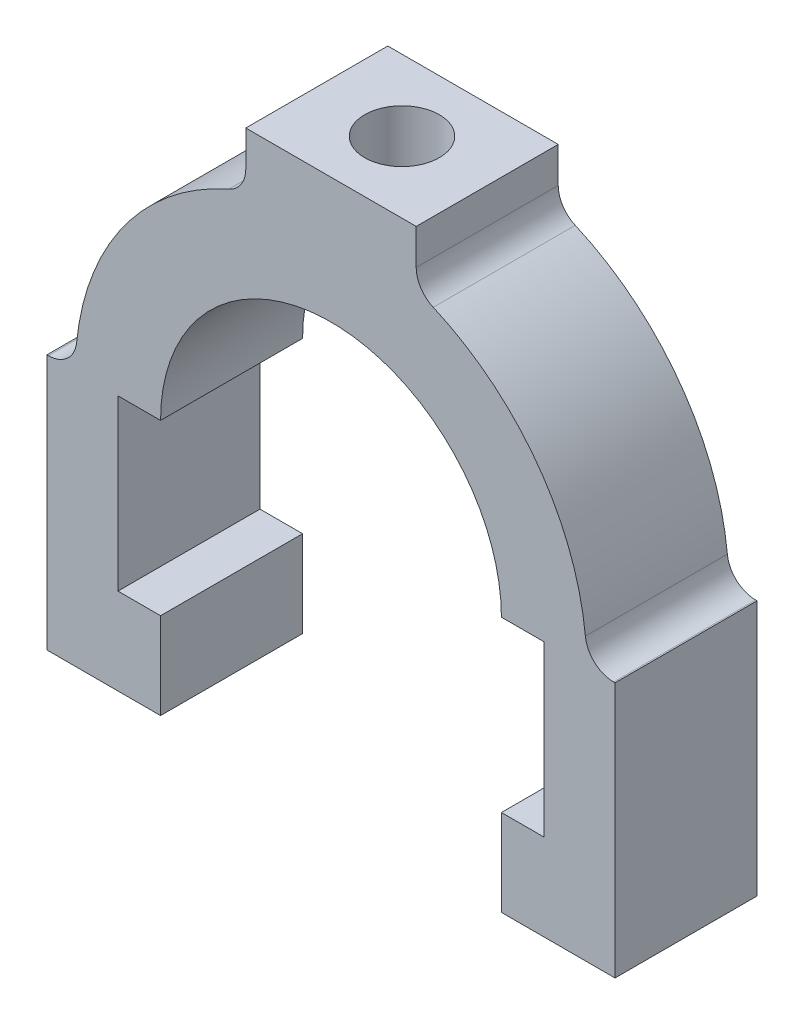
ISO-10303-21;
HEADER;
FILE_DESCRIPTION(('STEP AP214'),'2;1');
FILE_NAME('part.step','',(''),(''),'','','');
FILE_SCHEMA(('AUTOMOTIVE_DESIGN { 1 0 10303 214 1 1 1 1 }'));
ENDSEC;
DATA;
#1=APPLICATION_CONTEXT('core data for automotive mechanical design processes');
#2=APPLICATION_PROTOCOL_DEFINITION('international standard','automotive_design',2000,#1);
#3=PRODUCT_CONTEXT('',#1,'mechanical');
#4=PRODUCT('Part','Part','',(#3));
#5=PRODUCT_RELATED_PRODUCT_CATEGORY('part','',(#4));
#6=PRODUCT_DEFINITION_FORMATION('','',#4);
#7=PRODUCT_DEFINITION_CONTEXT('part definition',#1,'design');
#8=PRODUCT_DEFINITION('design','',#6,#7);
#9=PRODUCT_DEFINITION_SHAPE('','',#8);
#10=(LENGTH_UNIT() NAMED_UNIT(*) SI_UNIT(.MILLI.,.METRE.));
#11=(NAMED_UNIT(*) PLANE_ANGLE_UNIT() SI_UNIT($,.RADIAN.));
#12=(NAMED_UNIT(*) SI_UNIT($,.STERADIAN.) SOLID_ANGLE_UNIT());
#13=UNCERTAINTY_MEASURE_WITH_UNIT(LENGTH_MEASURE(1.E-05),#10,'distance_accuracy_value','');
#14=(GEOMETRIC_REPRESENTATION_CONTEXT(3) GLOBAL_UNCERTAINTY_ASSIGNED_CONTEXT((#13)) GLOBAL_UNIT_ASSIGNED_CONTEXT((#10,
#11,#12)) REPRESENTATION_CONTEXT('',''));
#15=CARTESIAN_POINT('',(0.,0.,0.));
#16=DIRECTION('',(0.,0.,1.));
#17=DIRECTION('',(1.,0.,0.));
#18=AXIS2_PLACEMENT_3D('',#15,#16,#17);
#19=CARTESIAN_POINT('',(24.,0.,20.));
#20=DIRECTION('',(0.,1.,0.));
#21=DIRECTION('',(0.,0.,1.));
#22=AXIS2_PLACEMENT_3D('',#19,#20,#21);
#23=PLANE('',#22);
#24=DIRECTION('',(1.,0.,0.));
#25=VECTOR('',#24,1.);
#26=CARTESIAN_POINT('',(24.,0.,0.));
#27=LINE('',#26,#25);
#28=CARTESIAN_POINT('',(24.,0.,0.));
#29=VERTEX_POINT('',#28);
#30=CARTESIAN_POINT('',(30.,0.,0.));
#31=VERTEX_POINT('',#30);
#32=EDGE_CURVE('E242',#29,#31,#27,.T.);
#33=ORIENTED_EDGE('',*,*,#32,.T.);
#34=DIRECTION('',(0.,0.,-1.));
#35=VECTOR('',#34,1.);
#36=CARTESIAN_POINT('',(30.,0.,20.));
#37=LINE('',#36,#35);
#38=CARTESIAN_POINT('',(30.,0.,20.));
#39=VERTEX_POINT('',#38);
#40=EDGE_CURVE('E11',#39,#31,#37,.T.);
#41=ORIENTED_EDGE('',*,*,#40,.F.);
#42=DIRECTION('',(1.,0.,0.));
#43=VECTOR('',#42,1.);
#44=CARTESIAN_POINT('',(24.,0.,20.));
#45=LINE('',#44,#43);
#46=CARTESIAN_POINT('',(24.,0.,20.));
#47=VERTEX_POINT('',#46);
#48=EDGE_CURVE('E312',#47,#39,#45,.T.);
#49=ORIENTED_EDGE('',*,*,#48,.F.);
#50=DIRECTION('',(0.,0.,-1.));
#51=VECTOR('',#50,1.);
#52=CARTESIAN_POINT('',(24.,0.,20.));
#53=LINE('',#52,#51);
#54=EDGE_CURVE('E238',#47,#29,#53,.T.);
#55=ORIENTED_EDGE('',*,*,#54,.T.);
#56=EDGE_LOOP('',(#33,#41,#49,#55));
#57=FACE_BOUND('',#56,.T.);
#58=ADVANCED_FACE('F39',(#57),#23,.F.);
#59=CARTESIAN_POINT('',(30.,0.,20.));
#60=DIRECTION('',(1.,0.,0.));
#61=DIRECTION('',(0.,1.,0.));
#62=AXIS2_PLACEMENT_3D('',#59,#60,#61);
#63=PLANE('',#62);
#64=DIRECTION('',(0.,-1.,0.));
#65=VECTOR('',#64,1.);
#66=CARTESIAN_POINT('',(30.,0.,0.));
#67=LINE('',#66,#65);
#68=CARTESIAN_POINT('',(30.,-23.8167393900885,0.));
#69=VERTEX_POINT('',#68);
#70=EDGE_CURVE('E246',#31,#69,#67,.T.);
#71=ORIENTED_EDGE('',*,*,#70,.T.);
#72=DIRECTION('',(0.,0.,-1.));
#73=VECTOR('',#72,1.);
#74=CARTESIAN_POINT('',(30.,-23.8167393900885,20.));
#75=LINE('',#74,#73);
#76=CARTESIAN_POINT('',(30.,-23.8167393900885,20.));
#77=VERTEX_POINT('',#76);
#78=EDGE_CURVE('E54',#77,#69,#75,.T.);
#79=ORIENTED_EDGE('',*,*,#78,.F.);
#80=DIRECTION('',(0.,-1.,0.));
#81=VECTOR('',#80,1.);
#82=CARTESIAN_POINT('',(30.,0.,20.));
#83=LINE('',#82,#81);
#84=EDGE_CURVE('E153',#39,#77,#83,.T.);
#85=ORIENTED_EDGE('',*,*,#84,.F.);
#86=ORIENTED_EDGE('',*,*,#40,.T.);
#87=EDGE_LOOP('',(#71,#79,#85,#86));
#88=FACE_BOUND('',#87,.T.);
#89=ADVANCED_FACE('F493',(#88),#63,.F.);
#90=CARTESIAN_POINT('',(24.,-23.8167393900885,20.));
#91=DIRECTION('',(0.,-1.,0.));
#92=DIRECTION('',(1.,0.,0.));
#93=AXIS2_PLACEMENT_3D('',#90,#91,#92);
#94=PLANE('',#93);
#95=DIRECTION('',(-1.,0.,0.));
#96=VECTOR('',#95,1.);
#97=CARTESIAN_POINT('',(24.,-23.8167393900885,0.));
#98=LINE('',#97,#96);
#99=CARTESIAN_POINT('',(24.,-23.8167393900885,0.));
#100=VERTEX_POINT('',#99);
#101=EDGE_CURVE('E249',#69,#100,#98,.T.);
#102=ORIENTED_EDGE('',*,*,#101,.T.);
#103=DIRECTION('',(0.,0.,-1.));
#104=VECTOR('',#103,1.);
#105=CARTESIAN_POINT('',(24.,-23.8167393900885,20.));
#106=LINE('',#105,#104);
#107=CARTESIAN_POINT('',(24.,-23.8167393900885,20.));
#108=VERTEX_POINT('',#107);
#109=EDGE_CURVE('E387',#108,#100,#106,.T.);
#110=ORIENTED_EDGE('',*,*,#109,.F.);
#111=DIRECTION('',(-1.,0.,0.));
#112=VECTOR('',#111,1.);
#113=CARTESIAN_POINT('',(24.,-23.8167393900885,20.));
#114=LINE('',#113,#112);
#115=EDGE_CURVE('E398',#77,#108,#114,.T.);
#116=ORIENTED_EDGE('',*,*,#115,.F.);
#117=ORIENTED_EDGE('',*,*,#78,.T.);
#118=EDGE_LOOP('',(#102,#110,#116,#117));
#119=FACE_BOUND('',#118,.T.);
#120=ADVANCED_FACE('F396',(#119),#94,.F.);
#121=CARTESIAN_POINT('',(24.,-36.,20.));
#122=DIRECTION('',(1.,0.,0.));
#123=DIRECTION('',(0.,0.,-1.));
#124=AXIS2_PLACEMENT_3D('',#121,#122,#123);
#125=PLANE('',#124);
#126=DIRECTION('',(0.,-1.,0.));
#127=VECTOR('',#126,1.);
#128=CARTESIAN_POINT('',(24.,-36.,0.));
#129=LINE('',#128,#127);
#130=CARTESIAN_POINT('',(24.,-36.,0.));
#131=VERTEX_POINT('',#130);
#132=EDGE_CURVE('E252',#100,#131,#129,.T.);
#133=ORIENTED_EDGE('',*,*,#132,.T.);
#134=DIRECTION('',(0.,0.,-1.));
#135=VECTOR('',#134,1.);
#136=CARTESIAN_POINT('',(24.,-36.,20.));
#137=LINE('',#136,#135);
#138=CARTESIAN_POINT('',(24.,-36.,20.));
#139=VERTEX_POINT('',#138);
#140=EDGE_CURVE('E383',#139,#131,#137,.T.);
#141=ORIENTED_EDGE('',*,*,#140,.F.);
#142=DIRECTION('',(0.,-1.,0.));
#143=VECTOR('',#142,1.);
#144=CARTESIAN_POINT('',(24.,-36.,20.));
#145=LINE('',#144,#143);
#146=EDGE_CURVE('E417',#108,#139,#145,.T.);
#147=ORIENTED_EDGE('',*,*,#146,.F.);
#148=ORIENTED_EDGE('',*,*,#109,.T.);
#149=EDGE_LOOP('',(#133,#141,#147,#148));
#150=FACE_BOUND('',#149,.T.);
#151=ADVANCED_FACE('F407',(#150),#125,.F.);
#152=CARTESIAN_POINT('',(40.,-36.,20.));
#153=DIRECTION('',(0.,1.,0.));
#154=DIRECTION('',(0.,0.,1.));
#155=AXIS2_PLACEMENT_3D('',#152,#153,#154);
#156=PLANE('',#155);
#157=DIRECTION('',(1.,0.,0.));
#158=VECTOR('',#157,1.);
#159=CARTESIAN_POINT('',(40.,-36.,0.));
#160=LINE('',#159,#158);
#161=CARTESIAN_POINT('',(40.,-36.,0.));
#162=VERTEX_POINT('',#161);
#163=EDGE_CURVE('E255',#131,#162,#160,.T.);
#164=ORIENTED_EDGE('',*,*,#163,.T.);
#165=DIRECTION('',(0.,0.,-1.));
#166=VECTOR('',#165,1.);
#167=CARTESIAN_POINT('',(40.,-36.,20.));
#168=LINE('',#167,#166);
#169=CARTESIAN_POINT('',(40.,-36.,20.));
#170=VERTEX_POINT('',#169);
#171=EDGE_CURVE('E379',#170,#162,#168,.T.);
#172=ORIENTED_EDGE('',*,*,#171,.F.);
#173=DIRECTION('',(1.,0.,0.));
#174=VECTOR('',#173,1.);
#175=CARTESIAN_POINT('',(40.,-36.,20.));
#176=LINE('',#175,#174);
#177=EDGE_CURVE('E413',#139,#170,#176,.T.);
#178=ORIENTED_EDGE('',*,*,#177,.F.);
#179=ORIENTED_EDGE('',*,*,#140,.T.);
#180=EDGE_LOOP('',(#164,#172,#178,#179));
#181=FACE_BOUND('',#180,.T.);
#182=ADVANCED_FACE('F411',(#181),#156,.F.);
#183=CARTESIAN_POINT('',(40.,0.,20.));
#184=DIRECTION('',(-1.,0.,0.));
#185=DIRECTION('',(0.,-1.,0.));
#186=AXIS2_PLACEMENT_3D('',#183,#184,#185);
#187=PLANE('',#186);
#188=DIRECTION('',(0.,1.,0.));
#189=VECTOR('',#188,1.);
#190=CARTESIAN_POINT('',(40.,0.,0.));
#191=LINE('',#190,#189);
#192=CARTESIAN_POINT('',(40.,0.,0.));
#193=VERTEX_POINT('',#192);
#194=EDGE_CURVE('E258',#162,#193,#191,.T.);
#195=ORIENTED_EDGE('',*,*,#194,.T.);
#196=DIRECTION('',(0.,0.,-1.));
#197=VECTOR('',#196,1.);
#198=CARTESIAN_POINT('',(40.,0.,20.));
#199=LINE('',#198,#197);
#200=CARTESIAN_POINT('',(40.,0.,20.));
#201=VERTEX_POINT('',#200);
#202=EDGE_CURVE('E375',#201,#193,#199,.T.);
#203=ORIENTED_EDGE('',*,*,#202,.F.);
#204=DIRECTION('',(0.,1.,0.));
#205=VECTOR('',#204,1.);
#206=CARTESIAN_POINT('',(40.,0.,20.));
#207=LINE('',#206,#205);
#208=EDGE_CURVE('E416',#170,#201,#207,.T.);
#209=ORIENTED_EDGE('',*,*,#208,.F.);
#210=ORIENTED_EDGE('',*,*,#171,.T.);
#211=EDGE_LOOP('',(#195,#203,#209,#210));
#212=FACE_BOUND('',#211,.T.);
#213=ADVANCED_FACE('F506',(#212),#187,.F.);
#214=CARTESIAN_POINT('',(39.7994974842648,0.,20.));
#215=DIRECTION('',(0.,-1.,0.));
#216=DIRECTION('',(0.,0.,-1.));
#217=AXIS2_PLACEMENT_3D('',#214,#215,#216);
#218=PLANE('',#217);
#219=DIRECTION('',(-1.,0.,0.));
#220=VECTOR('',#219,1.);
#221=CARTESIAN_POINT('',(39.7994974842648,0.,0.));
#222=LINE('',#221,#220);
#223=CARTESIAN_POINT('',(39.7994974842648,0.,0.));
#224=VERTEX_POINT('',#223);
#225=EDGE_CURVE('E261',#193,#224,#222,.T.);
#226=ORIENTED_EDGE('',*,*,#225,.T.);
#227=DIRECTION('',(0.,0.,-1.));
#228=VECTOR('',#227,1.);
#229=CARTESIAN_POINT('',(39.7994974842648,0.,20.));
#230=LINE('',#229,#228);
#231=CARTESIAN_POINT('',(39.7994974842648,0.,20.));
#232=VERTEX_POINT('',#231);
#233=EDGE_CURVE('E371',#232,#224,#230,.T.);
#234=ORIENTED_EDGE('',*,*,#233,.F.);
#235=DIRECTION('',(-1.,0.,0.));
#236=VECTOR('',#235,1.);
#237=CARTESIAN_POINT('',(39.7994974842648,0.,20.));
#238=LINE('',#237,#236);
#239=EDGE_CURVE('E421',#201,#232,#238,.T.);
#240=ORIENTED_EDGE('',*,*,#239,.F.);
#241=ORIENTED_EDGE('',*,*,#202,.T.);
#242=EDGE_LOOP('',(#226,#234,#240,#241));
#243=FACE_BOUND('',#242,.T.);
#244=ADVANCED_FACE('F509',(#243),#218,.F.);
#245=CARTESIAN_POINT('',(39.7994974842648,4.,20.));
#246=DIRECTION('',(0.,0.,-1.));
#247=DIRECTION('',(-1.,0.,0.));
#248=AXIS2_PLACEMENT_3D('',#245,#246,#247);
#249=CYLINDRICAL_SURFACE('',#248,4.);
#250=CARTESIAN_POINT('',(39.7994974842648,4.,0.));
#251=DIRECTION('',(0.,0.,-1.));
#252=DIRECTION('',(1.,0.,0.));
#253=AXIS2_PLACEMENT_3D('',#250,#251,#252);
#254=CIRCLE('',#253,4.);
#255=CARTESIAN_POINT('',(35.8195477358383,3.6,0.));
#256=VERTEX_POINT('',#255);
#257=EDGE_CURVE('E264',#224,#256,#254,.T.);
#258=ORIENTED_EDGE('',*,*,#257,.T.);
#259=DIRECTION('',(0.,0.,-1.));
#260=VECTOR('',#259,1.);
#261=CARTESIAN_POINT('',(35.8195477358383,3.6,20.));
#262=LINE('',#261,#260);
#263=CARTESIAN_POINT('',(35.8195477358383,3.6,20.));
#264=VERTEX_POINT('',#263);
#265=EDGE_CURVE('E367',#264,#256,#262,.T.);
#266=ORIENTED_EDGE('',*,*,#265,.F.);
#267=CARTESIAN_POINT('',(39.7994974842648,4.,20.));
#268=DIRECTION('',(0.,0.,-1.));
#269=DIRECTION('',(1.,0.,0.));
#270=AXIS2_PLACEMENT_3D('',#267,#268,#269);
#271=CIRCLE('',#270,4.);
#272=EDGE_CURVE('E428',#232,#264,#271,.T.);
#273=ORIENTED_EDGE('',*,*,#272,.F.);
#274=ORIENTED_EDGE('',*,*,#233,.T.);
#275=EDGE_LOOP('',(#258,#266,#273,#274));
#276=FACE_BOUND('',#275,.T.);
#277=ADVANCED_FACE('F513',(#276),#249,.F.);
#278=CARTESIAN_POINT('',(0.,0.,20.));
#279=DIRECTION('',(0.,0.,-1.));
#280=DIRECTION('',(-1.,0.,0.));
#281=AXIS2_PLACEMENT_3D('',#278,#279,#280);
#282=CYLINDRICAL_SURFACE('',#281,36.);
#283=CARTESIAN_POINT('',(0.,0.,0.));
#284=DIRECTION('',(0.,0.,1.));
#285=DIRECTION('',(1.,0.,0.));
#286=AXIS2_PLACEMENT_3D('',#283,#284,#285);
#287=CIRCLE('',#286,36.);
#288=CARTESIAN_POINT('',(14.4,32.994545003682,0.));
#289=VERTEX_POINT('',#288);
#290=EDGE_CURVE('E267',#256,#289,#287,.T.);
#291=ORIENTED_EDGE('',*,*,#290,.T.);
#292=DIRECTION('',(0.,0.,-1.));
#293=VECTOR('',#292,1.);
#294=CARTESIAN_POINT('',(14.4,32.994545003682,20.));
#295=LINE('',#294,#293);
#296=CARTESIAN_POINT('',(14.4,32.994545003682,20.));
#297=VERTEX_POINT('',#296);
#298=EDGE_CURVE('E363',#297,#289,#295,.T.);
#299=ORIENTED_EDGE('',*,*,#298,.F.);
#300=CARTESIAN_POINT('',(0.,0.,20.));
#301=DIRECTION('',(0.,0.,1.));
#302=DIRECTION('',(1.,0.,0.));
#303=AXIS2_PLACEMENT_3D('',#300,#301,#302);
#304=CIRCLE('',#303,36.);
#305=EDGE_CURVE('E431',#264,#297,#304,.T.);
#306=ORIENTED_EDGE('',*,*,#305,.F.);
#307=ORIENTED_EDGE('',*,*,#265,.T.);
#308=EDGE_LOOP('',(#291,#299,#306,#307));
#309=FACE_BOUND('',#308,.T.);
#310=ADVANCED_FACE('F517',(#309),#282,.T.);
#311=CARTESIAN_POINT('',(16.,36.6606055596467,20.));
#312=DIRECTION('',(0.,0.,-1.));
#313=DIRECTION('',(-1.,0.,0.));
#314=AXIS2_PLACEMENT_3D('',#311,#312,#313);
#315=CYLINDRICAL_SURFACE('',#314,4.);
#316=CARTESIAN_POINT('',(16.,36.6606055596467,0.));
#317=DIRECTION('',(0.,0.,-1.));
#318=DIRECTION('',(1.,0.,0.));
#319=AXIS2_PLACEMENT_3D('',#316,#317,#318);
#320=CIRCLE('',#319,4.);
#321=CARTESIAN_POINT('',(12.,36.6606055596467,0.));
#322=VERTEX_POINT('',#321);
#323=EDGE_CURVE('E270',#289,#322,#320,.T.);
#324=ORIENTED_EDGE('',*,*,#323,.T.);
#325=DIRECTION('',(0.,0.,-1.));
#326=VECTOR('',#325,1.);
#327=CARTESIAN_POINT('',(12.,36.6606055596467,20.));
#328=LINE('',#327,#326);
#329=CARTESIAN_POINT('',(12.,36.6606055596467,20.));
#330=VERTEX_POINT('',#329);
#331=EDGE_CURVE('E359',#330,#322,#328,.T.);
#332=ORIENTED_EDGE('',*,*,#331,.F.);
#333=CARTESIAN_POINT('',(16.,36.6606055596467,20.));
#334=DIRECTION('',(0.,0.,-1.));
#335=DIRECTION('',(1.,0.,0.));
#336=AXIS2_PLACEMENT_3D('',#333,#334,#335);
#337=CIRCLE('',#336,4.);
#338=EDGE_CURVE('E434',#297,#330,#337,.T.);
#339=ORIENTED_EDGE('',*,*,#338,.F.);
#340=ORIENTED_EDGE('',*,*,#298,.T.);
#341=EDGE_LOOP('',(#324,#332,#339,#340));
#342=FACE_BOUND('',#341,.T.);
#343=ADVANCED_FACE('F521',(#342),#315,.F.);
#344=CARTESIAN_POINT('',(12.,41.6606055596467,20.));
#345=DIRECTION('',(-1.,0.,0.));
#346=DIRECTION('',(0.,-1.,0.));
#347=AXIS2_PLACEMENT_3D('',#344,#345,#346);
#348=PLANE('',#347);
#349=DIRECTION('',(0.,1.,0.));
#350=VECTOR('',#349,1.);
#351=CARTESIAN_POINT('',(12.,41.6606055596467,0.));
#352=LINE('',#351,#350);
#353=CARTESIAN_POINT('',(12.,41.6606055596467,0.));
#354=VERTEX_POINT('',#353);
#355=EDGE_CURVE('E273',#322,#354,#352,.T.);
#356=ORIENTED_EDGE('',*,*,#355,.T.);
#357=DIRECTION('',(0.,0.,-1.));
#358=VECTOR('',#357,1.);
#359=CARTESIAN_POINT('',(12.,41.6606055596467,20.));
#360=LINE('',#359,#358);
#361=CARTESIAN_POINT('',(12.,41.6606055596467,20.));
#362=VERTEX_POINT('',#361);
#363=EDGE_CURVE('E355',#362,#354,#360,.T.);
#364=ORIENTED_EDGE('',*,*,#363,.F.);
#365=DIRECTION('',(0.,1.,0.));
#366=VECTOR('',#365,1.);
#367=CARTESIAN_POINT('',(12.,41.6606055596467,20.));
#368=LINE('',#367,#366);
#369=EDGE_CURVE('E437',#330,#362,#368,.T.);
#370=ORIENTED_EDGE('',*,*,#369,.F.);
#371=ORIENTED_EDGE('',*,*,#331,.T.);
#372=EDGE_LOOP('',(#356,#364,#370,#371));
#373=FACE_BOUND('',#372,.T.);
#374=ADVANCED_FACE('F525',(#373),#348,.F.);
#375=CARTESIAN_POINT('',(-12.,41.6606055596467,20.));
#376=DIRECTION('',(0.,-1.,0.));
#377=DIRECTION('',(0.,0.,-1.));
#378=AXIS2_PLACEMENT_3D('',#375,#376,#377);
#379=PLANE('',#378);
#380=CARTESIAN_POINT('',(0.,41.6606055596467,10.));
#381=DIRECTION('',(0.,1.,0.));
#382=DIRECTION('',(0.,0.,1.));
#383=AXIS2_PLACEMENT_3D('',#380,#381,#382);
#384=CIRCLE('',#383,5.25129435468672);
#385=CARTESIAN_POINT('',(0.,41.6606055596467,15.2512943546867));
#386=VERTEX_POINT('',#385);
#387=EDGE_CURVE('E617',#386,#386,#384,.T.);
#388=ORIENTED_EDGE('',*,*,#387,.F.);
#389=EDGE_LOOP('',(#388));
#390=FACE_BOUND('',#389,.T.);
#391=DIRECTION('',(-1.,0.,0.));
#392=VECTOR('',#391,1.);
#393=CARTESIAN_POINT('',(-12.,41.6606055596467,0.));
#394=LINE('',#393,#392);
#395=CARTESIAN_POINT('',(-12.,41.6606055596467,0.));
#396=VERTEX_POINT('',#395);
#397=EDGE_CURVE('E276',#354,#396,#394,.T.);
#398=ORIENTED_EDGE('',*,*,#397,.T.);
#399=DIRECTION('',(0.,0.,-1.));
#400=VECTOR('',#399,1.);
#401=CARTESIAN_POINT('',(-12.,41.6606055596467,20.));
#402=LINE('',#401,#400);
#403=CARTESIAN_POINT('',(-12.,41.6606055596467,20.));
#404=VERTEX_POINT('',#403);
#405=EDGE_CURVE('E351',#404,#396,#402,.T.);
#406=ORIENTED_EDGE('',*,*,#405,.F.);
#407=DIRECTION('',(-1.,0.,0.));
#408=VECTOR('',#407,1.);
#409=CARTESIAN_POINT('',(-12.,41.6606055596467,20.));
#410=LINE('',#409,#408);
#411=EDGE_CURVE('E440',#362,#404,#410,.T.);
#412=ORIENTED_EDGE('',*,*,#411,.F.);
#413=ORIENTED_EDGE('',*,*,#363,.T.);
#414=EDGE_LOOP('',(#398,#406,#412,#413));
#415=FACE_BOUND('',#414,.T.);
#416=ADVANCED_FACE('F529',(#390,#415),#379,.F.);
#417=CARTESIAN_POINT('',(-12.,41.6606055596467,20.));
#418=DIRECTION('',(1.,0.,0.));
#419=DIRECTION('',(0.,0.,-1.));
#420=AXIS2_PLACEMENT_3D('',#417,#418,#419);
#421=PLANE('',#420);
#422=DIRECTION('',(0.,-1.,0.));
#423=VECTOR('',#422,1.);
#424=CARTESIAN_POINT('',(-12.,41.6606055596467,0.));
#425=LINE('',#424,#423);
#426=CARTESIAN_POINT('',(-12.,36.6606055596467,0.));
#427=VERTEX_POINT('',#426);
#428=EDGE_CURVE('E279',#396,#427,#425,.T.);
#429=ORIENTED_EDGE('',*,*,#428,.T.);
#430=DIRECTION('',(0.,0.,-1.));
#431=VECTOR('',#430,1.);
#432=CARTESIAN_POINT('',(-12.,36.6606055596467,20.));
#433=LINE('',#432,#431);
#434=CARTESIAN_POINT('',(-12.,36.6606055596467,20.));
#435=VERTEX_POINT('',#434);
#436=EDGE_CURVE('E347',#435,#427,#433,.T.);
#437=ORIENTED_EDGE('',*,*,#436,.F.);
#438=DIRECTION('',(0.,-1.,0.));
#439=VECTOR('',#438,1.);
#440=CARTESIAN_POINT('',(-12.,41.6606055596467,20.));
#441=LINE('',#440,#439);
#442=EDGE_CURVE('E443',#404,#435,#441,.T.);
#443=ORIENTED_EDGE('',*,*,#442,.F.);
#444=ORIENTED_EDGE('',*,*,#405,.T.);
#445=EDGE_LOOP('',(#429,#437,#443,#444));
#446=FACE_BOUND('',#445,.T.);
#447=ADVANCED_FACE('F533',(#446),#421,.F.);
#448=CARTESIAN_POINT('',(-16.,36.6606055596467,20.));
#449=DIRECTION('',(0.,0.,-1.));
#450=DIRECTION('',(-1.,0.,0.));
#451=AXIS2_PLACEMENT_3D('',#448,#449,#450);
#452=CYLINDRICAL_SURFACE('',#451,4.);
#453=CARTESIAN_POINT('',(-16.,36.6606055596467,0.));
#454=DIRECTION('',(0.,0.,-1.));
#455=DIRECTION('',(-1.,0.,0.));
#456=AXIS2_PLACEMENT_3D('',#453,#454,#455);
#457=CIRCLE('',#456,4.);
#458=CARTESIAN_POINT('',(-14.4,32.994545003682,0.));
#459=VERTEX_POINT('',#458);
#460=EDGE_CURVE('E282',#427,#459,#457,.T.);
#461=ORIENTED_EDGE('',*,*,#460,.T.);
#462=DIRECTION('',(0.,0.,-1.));
#463=VECTOR('',#462,1.);
#464=CARTESIAN_POINT('',(-14.4,32.994545003682,20.));
#465=LINE('',#464,#463);
#466=CARTESIAN_POINT('',(-14.4,32.994545003682,20.));
#467=VERTEX_POINT('',#466);
#468=EDGE_CURVE('E343',#467,#459,#465,.T.);
#469=ORIENTED_EDGE('',*,*,#468,.F.);
#470=CARTESIAN_POINT('',(-16.,36.6606055596467,20.));
#471=DIRECTION('',(0.,0.,-1.));
#472=DIRECTION('',(-1.,0.,0.));
#473=AXIS2_PLACEMENT_3D('',#470,#471,#472);
#474=CIRCLE('',#473,4.);
#475=EDGE_CURVE('E446',#435,#467,#474,.T.);
#476=ORIENTED_EDGE('',*,*,#475,.F.);
#477=ORIENTED_EDGE('',*,*,#436,.T.);
#478=EDGE_LOOP('',(#461,#469,#476,#477));
#479=FACE_BOUND('',#478,.T.);
#480=ADVANCED_FACE('F537',(#479),#452,.F.);
#481=CARTESIAN_POINT('',(0.,0.,20.));
#482=DIRECTION('',(0.,0.,-1.));
#483=DIRECTION('',(-1.,0.,0.));
#484=AXIS2_PLACEMENT_3D('',#481,#482,#483);
#485=CYLINDRICAL_SURFACE('',#484,36.);
#486=CARTESIAN_POINT('',(0.,0.,0.));
#487=DIRECTION('',(0.,0.,1.));
#488=DIRECTION('',(1.,0.,0.));
#489=AXIS2_PLACEMENT_3D('',#486,#487,#488);
#490=CIRCLE('',#489,36.);
#491=CARTESIAN_POINT('',(-35.8195477358383,3.6,0.));
#492=VERTEX_POINT('',#491);
#493=EDGE_CURVE('E285',#459,#492,#490,.T.);
#494=ORIENTED_EDGE('',*,*,#493,.T.);
#495=DIRECTION('',(0.,0.,-1.));
#496=VECTOR('',#495,1.);
#497=CARTESIAN_POINT('',(-35.8195477358383,3.6,20.));
#498=LINE('',#497,#496);
#499=CARTESIAN_POINT('',(-35.8195477358383,3.6,20.));
#500=VERTEX_POINT('',#499);
#501=EDGE_CURVE('E339',#500,#492,#498,.T.);
#502=ORIENTED_EDGE('',*,*,#501,.F.);
#503=CARTESIAN_POINT('',(0.,0.,20.));
#504=DIRECTION('',(0.,0.,1.));
#505=DIRECTION('',(1.,0.,0.));
#506=AXIS2_PLACEMENT_3D('',#503,#504,#505);
#507=CIRCLE('',#506,36.);
#508=EDGE_CURVE('E449',#467,#500,#507,.T.);
#509=ORIENTED_EDGE('',*,*,#508,.F.);
#510=ORIENTED_EDGE('',*,*,#468,.T.);
#511=EDGE_LOOP('',(#494,#502,#509,#510));
#512=FACE_BOUND('',#511,.T.);
#513=ADVANCED_FACE('F541',(#512),#485,.T.);
#514=CARTESIAN_POINT('',(-39.7994974842648,4.,20.));
#515=DIRECTION('',(0.,0.,-1.));
#516=DIRECTION('',(-1.,0.,0.));
#517=AXIS2_PLACEMENT_3D('',#514,#515,#516);
#518=CYLINDRICAL_SURFACE('',#517,4.);
#519=CARTESIAN_POINT('',(-39.7994974842648,4.,0.));
#520=DIRECTION('',(0.,0.,-1.));
#521=DIRECTION('',(-1.,0.,0.));
#522=AXIS2_PLACEMENT_3D('',#519,#520,#521);
#523=CIRCLE('',#522,4.);
#524=CARTESIAN_POINT('',(-39.7994974842648,0.,0.));
#525=VERTEX_POINT('',#524);
#526=EDGE_CURVE('E288',#492,#525,#523,.T.);
#527=ORIENTED_EDGE('',*,*,#526,.T.);
#528=DIRECTION('',(0.,0.,-1.));
#529=VECTOR('',#528,1.);
#530=CARTESIAN_POINT('',(-39.7994974842648,0.,20.));
#531=LINE('',#530,#529);
#532=CARTESIAN_POINT('',(-39.7994974842648,0.,20.));
#533=VERTEX_POINT('',#532);
#534=EDGE_CURVE('E335',#533,#525,#531,.T.);
#535=ORIENTED_EDGE('',*,*,#534,.F.);
#536=CARTESIAN_POINT('',(-39.7994974842648,4.,20.));
#537=DIRECTION('',(0.,0.,-1.));
#538=DIRECTION('',(-1.,0.,0.));
#539=AXIS2_PLACEMENT_3D('',#536,#537,#538);
#540=CIRCLE('',#539,4.);
#541=EDGE_CURVE('E452',#500,#533,#540,.T.);
#542=ORIENTED_EDGE('',*,*,#541,.F.);
#543=ORIENTED_EDGE('',*,*,#501,.T.);
#544=EDGE_LOOP('',(#527,#535,#542,#543));
#545=FACE_BOUND('',#544,.T.);
#546=ADVANCED_FACE('F545',(#545),#518,.F.);
#547=CARTESIAN_POINT('',(-39.7994974842648,0.,20.));
#548=DIRECTION('',(0.,-1.,0.));
#549=DIRECTION('',(1.,0.,0.));
#550=AXIS2_PLACEMENT_3D('',#547,#548,#549);
#551=PLANE('',#550);
#552=DIRECTION('',(-1.,0.,0.));
#553=VECTOR('',#552,1.);
#554=CARTESIAN_POINT('',(-39.7994974842648,0.,0.));
#555=LINE('',#554,#553);
#556=CARTESIAN_POINT('',(-40.,0.,0.));
#557=VERTEX_POINT('',#556);
#558=EDGE_CURVE('E291',#525,#557,#555,.T.);
#559=ORIENTED_EDGE('',*,*,#558,.T.);
#560=DIRECTION('',(0.,0.,-1.));
#561=VECTOR('',#560,1.);
#562=CARTESIAN_POINT('',(-40.,0.,20.));
#563=LINE('',#562,#561);
#564=CARTESIAN_POINT('',(-40.,0.,20.));
#565=VERTEX_POINT('',#564);
#566=EDGE_CURVE('E331',#565,#557,#563,.T.);
#567=ORIENTED_EDGE('',*,*,#566,.F.);
#568=DIRECTION('',(-1.,0.,0.));
#569=VECTOR('',#568,1.);
#570=CARTESIAN_POINT('',(-39.7994974842648,0.,20.));
#571=LINE('',#570,#569);
#572=EDGE_CURVE('E455',#533,#565,#571,.T.);
#573=ORIENTED_EDGE('',*,*,#572,.F.);
#574=ORIENTED_EDGE('',*,*,#534,.T.);
#575=EDGE_LOOP('',(#559,#567,#573,#574));
#576=FACE_BOUND('',#575,.T.);
#577=ADVANCED_FACE('F549',(#576),#551,.F.);
#578=CARTESIAN_POINT('',(-40.,0.,20.));
#579=DIRECTION('',(1.,0.,0.));
#580=DIRECTION('',(0.,1.,0.));
#581=AXIS2_PLACEMENT_3D('',#578,#579,#580);
#582=PLANE('',#581);
#583=DIRECTION('',(0.,-1.,0.));
#584=VECTOR('',#583,1.);
#585=CARTESIAN_POINT('',(-40.,0.,0.));
#586=LINE('',#585,#584);
#587=CARTESIAN_POINT('',(-40.,-36.,0.));
#588=VERTEX_POINT('',#587);
#589=EDGE_CURVE('E294',#557,#588,#586,.T.);
#590=ORIENTED_EDGE('',*,*,#589,.T.);
#591=DIRECTION('',(0.,0.,-1.));
#592=VECTOR('',#591,1.);
#593=CARTESIAN_POINT('',(-40.,-36.,20.));
#594=LINE('',#593,#592);
#595=CARTESIAN_POINT('',(-40.,-36.,20.));
#596=VERTEX_POINT('',#595);
#597=EDGE_CURVE('E327',#596,#588,#594,.T.);
#598=ORIENTED_EDGE('',*,*,#597,.F.);
#599=DIRECTION('',(0.,-1.,0.));
#600=VECTOR('',#599,1.);
#601=CARTESIAN_POINT('',(-40.,0.,20.));
#602=LINE('',#601,#600);
#603=EDGE_CURVE('E458',#565,#596,#602,.T.);
#604=ORIENTED_EDGE('',*,*,#603,.F.);
#605=ORIENTED_EDGE('',*,*,#566,.T.);
#606=EDGE_LOOP('',(#590,#598,#604,#605));
#607=FACE_BOUND('',#606,.T.);
#608=ADVANCED_FACE('F553',(#607),#582,.F.);
#609=CARTESIAN_POINT('',(-40.,-36.,20.));
#610=DIRECTION('',(0.,1.,0.));
#611=DIRECTION('',(0.,0.,1.));
#612=AXIS2_PLACEMENT_3D('',#609,#610,#611);
#613=PLANE('',#612);
#614=DIRECTION('',(1.,0.,0.));
#615=VECTOR('',#614,1.);
#616=CARTESIAN_POINT('',(-40.,-36.,0.));
#617=LINE('',#616,#615);
#618=CARTESIAN_POINT('',(-24.,-36.,0.));
#619=VERTEX_POINT('',#618);
#620=EDGE_CURVE('E297',#588,#619,#617,.T.);
#621=ORIENTED_EDGE('',*,*,#620,.T.);
#622=DIRECTION('',(0.,0.,-1.));
#623=VECTOR('',#622,1.);
#624=CARTESIAN_POINT('',(-24.,-36.,20.));
#625=LINE('',#624,#623);
#626=CARTESIAN_POINT('',(-24.,-36.,20.));
#627=VERTEX_POINT('',#626);
#628=EDGE_CURVE('E323',#627,#619,#625,.T.);
#629=ORIENTED_EDGE('',*,*,#628,.F.);
#630=DIRECTION('',(1.,0.,0.));
#631=VECTOR('',#630,1.);
#632=CARTESIAN_POINT('',(-40.,-36.,20.));
#633=LINE('',#632,#631);
#634=EDGE_CURVE('E461',#596,#627,#633,.T.);
#635=ORIENTED_EDGE('',*,*,#634,.F.);
#636=ORIENTED_EDGE('',*,*,#597,.T.);
#637=EDGE_LOOP('',(#621,#629,#635,#636));
#638=FACE_BOUND('',#637,.T.);
#639=ADVANCED_FACE('F557',(#638),#613,.F.);
#640=CARTESIAN_POINT('',(-24.,-36.,20.));
#641=DIRECTION('',(-1.,0.,0.));
#642=DIRECTION('',(0.,0.,1.));
#643=AXIS2_PLACEMENT_3D('',#640,#641,#642);
#644=PLANE('',#643);
#645=DIRECTION('',(0.,1.,0.));
#646=VECTOR('',#645,1.);
#647=CARTESIAN_POINT('',(-24.,-36.,0.));
#648=LINE('',#647,#646);
#649=CARTESIAN_POINT('',(-24.,-23.8167393900885,0.));
#650=VERTEX_POINT('',#649);
#651=EDGE_CURVE('E300',#619,#650,#648,.T.);
#652=ORIENTED_EDGE('',*,*,#651,.T.);
#653=DIRECTION('',(0.,0.,-1.));
#654=VECTOR('',#653,1.);
#655=CARTESIAN_POINT('',(-24.,-23.8167393900885,20.));
#656=LINE('',#655,#654);
#657=CARTESIAN_POINT('',(-24.,-23.8167393900885,20.));
#658=VERTEX_POINT('',#657);
#659=EDGE_CURVE('E319',#658,#650,#656,.T.);
#660=ORIENTED_EDGE('',*,*,#659,.F.);
#661=DIRECTION('',(0.,1.,0.));
#662=VECTOR('',#661,1.);
#663=CARTESIAN_POINT('',(-24.,-36.,20.));
#664=LINE('',#663,#662);
#665=EDGE_CURVE('E464',#627,#658,#664,.T.);
#666=ORIENTED_EDGE('',*,*,#665,.F.);
#667=ORIENTED_EDGE('',*,*,#628,.T.);
#668=EDGE_LOOP('',(#652,#660,#666,#667));
#669=FACE_BOUND('',#668,.T.);
#670=ADVANCED_FACE('F472',(#669),#644,.F.);
#671=CARTESIAN_POINT('',(-24.,-23.8167393900885,20.));
#672=DIRECTION('',(0.,-1.,0.));
#673=DIRECTION('',(0.,0.,-1.));
#674=AXIS2_PLACEMENT_3D('',#671,#672,#673);
#675=PLANE('',#674);
#676=DIRECTION('',(-1.,0.,0.));
#677=VECTOR('',#676,1.);
#678=CARTESIAN_POINT('',(-24.,-23.8167393900885,0.));
#679=LINE('',#678,#677);
#680=CARTESIAN_POINT('',(-30.,-23.8167393900885,0.));
#681=VERTEX_POINT('',#680);
#682=EDGE_CURVE('E303',#650,#681,#679,.T.);
#683=ORIENTED_EDGE('',*,*,#682,.T.);
#684=DIRECTION('',(0.,0.,-1.));
#685=VECTOR('',#684,1.);
#686=CARTESIAN_POINT('',(-30.,-23.8167393900885,20.));
#687=LINE('',#686,#685);
#688=CARTESIAN_POINT('',(-30.,-23.8167393900885,20.));
#689=VERTEX_POINT('',#688);
#690=EDGE_CURVE('E231',#689,#681,#687,.T.);
#691=ORIENTED_EDGE('',*,*,#690,.F.);
#692=DIRECTION('',(-1.,0.,0.));
#693=VECTOR('',#692,1.);
#694=CARTESIAN_POINT('',(-24.,-23.8167393900885,20.));
#695=LINE('',#694,#693);
#696=EDGE_CURVE('E220',#658,#689,#695,.T.);
#697=ORIENTED_EDGE('',*,*,#696,.F.);
#698=ORIENTED_EDGE('',*,*,#659,.T.);
#699=EDGE_LOOP('',(#683,#691,#697,#698));
#700=FACE_BOUND('',#699,.T.);
#701=ADVANCED_FACE('F476',(#700),#675,.F.);
#702=CARTESIAN_POINT('',(-30.,0.,20.));
#703=DIRECTION('',(-1.,0.,0.));
#704=DIRECTION('',(0.,-1.,0.));
#705=AXIS2_PLACEMENT_3D('',#702,#703,#704);
#706=PLANE('',#705);
#707=DIRECTION('',(0.,1.,0.));
#708=VECTOR('',#707,1.);
#709=CARTESIAN_POINT('',(-30.,0.,0.));
#710=LINE('',#709,#708);
#711=CARTESIAN_POINT('',(-30.,0.,0.));
#712=VERTEX_POINT('',#711);
#713=EDGE_CURVE('E229',#681,#712,#710,.T.);
#714=ORIENTED_EDGE('',*,*,#713,.T.);
#715=DIRECTION('',(0.,0.,-1.));
#716=VECTOR('',#715,1.);
#717=CARTESIAN_POINT('',(-30.,0.,20.));
#718=LINE('',#717,#716);
#719=CARTESIAN_POINT('',(-30.,0.,20.));
#720=VERTEX_POINT('',#719);
#721=EDGE_CURVE('E226',#720,#712,#718,.T.);
#722=ORIENTED_EDGE('',*,*,#721,.F.);
#723=DIRECTION('',(0.,1.,0.));
#724=VECTOR('',#723,1.);
#725=CARTESIAN_POINT('',(-30.,0.,20.));
#726=LINE('',#725,#724);
#727=EDGE_CURVE('E214',#689,#720,#726,.T.);
#728=ORIENTED_EDGE('',*,*,#727,.F.);
#729=ORIENTED_EDGE('',*,*,#690,.T.);
#730=EDGE_LOOP('',(#714,#722,#728,#729));
#731=FACE_BOUND('',#730,.T.);
#732=ADVANCED_FACE('F227',(#731),#706,.F.);
#733=CARTESIAN_POINT('',(-30.,0.,20.));
#734=DIRECTION('',(0.,1.,0.));
#735=DIRECTION('',(0.,0.,1.));
#736=AXIS2_PLACEMENT_3D('',#733,#734,#735);
#737=PLANE('',#736);
#738=DIRECTION('',(1.,0.,0.));
#739=VECTOR('',#738,1.);
#740=CARTESIAN_POINT('',(-30.,0.,0.));
#741=LINE('',#740,#739);
#742=CARTESIAN_POINT('',(-24.,0.,0.));
#743=VERTEX_POINT('',#742);
#744=EDGE_CURVE('E139',#712,#743,#741,.T.);
#745=ORIENTED_EDGE('',*,*,#744,.T.);
#746=DIRECTION('',(0.,0.,-1.));
#747=VECTOR('',#746,1.);
#748=CARTESIAN_POINT('',(-24.,0.,20.));
#749=LINE('',#748,#747);
#750=CARTESIAN_POINT('',(-24.,0.,20.));
#751=VERTEX_POINT('',#750);
#752=EDGE_CURVE('E232',#751,#743,#749,.T.);
#753=ORIENTED_EDGE('',*,*,#752,.F.);
#754=DIRECTION('',(1.,0.,0.));
#755=VECTOR('',#754,1.);
#756=CARTESIAN_POINT('',(-30.,0.,20.));
#757=LINE('',#756,#755);
#758=EDGE_CURVE('E218',#720,#751,#757,.T.);
#759=ORIENTED_EDGE('',*,*,#758,.F.);
#760=ORIENTED_EDGE('',*,*,#721,.T.);
#761=EDGE_LOOP('',(#745,#753,#759,#760));
#762=FACE_BOUND('',#761,.T.);
#763=ADVANCED_FACE('F234',(#762),#737,.F.);
#764=CARTESIAN_POINT('',(0.,0.,20.));
#765=DIRECTION('',(0.,0.,-1.));
#766=DIRECTION('',(-1.,0.,0.));
#767=AXIS2_PLACEMENT_3D('',#764,#765,#766);
#768=CYLINDRICAL_SURFACE('',#767,24.);
#769=CARTESIAN_POINT('',(0.,24.,15.2512943546867));
#770=CARTESIAN_POINT('',(0.145672119942041,24.0000018425514,15.2512977273096));
#771=CARTESIAN_POINT('',(0.291303993221928,23.9986715417614,15.2452315446295));
#772=CARTESIAN_POINT('',(0.581555524666357,23.9933915130186,15.2210230794635));
#773=CARTESIAN_POINT('',(0.726175027952759,23.9894413927543,15.202878988339));
#774=CARTESIAN_POINT('',(1.01337567488735,23.9790270358369,15.1546464381336));
#775=CARTESIAN_POINT('',(1.15595588460314,23.972561683242,15.1245526771779));
#776=CARTESIAN_POINT('',(1.4380591909607,23.9572942083603,15.0526500518527));
#777=CARTESIAN_POINT('',(1.57758114246378,23.948491226419,15.010836877397));
#778=CARTESIAN_POINT('',(1.8523417144346,23.9288064127098,14.9158946508718));
#779=CARTESIAN_POINT('',(1.98758618596817,23.9179275777718,14.8627818990199));
#780=CARTESIAN_POINT('',(2.25313028560996,23.894375481295,14.7455839042265));
#781=CARTESIAN_POINT('',(2.3834280677823,23.8817015580765,14.6814946134397));
#782=CARTESIAN_POINT('',(2.63810436276834,23.8549113512301,14.5428526073998));
#783=CARTESIAN_POINT('',(2.7624853173455,23.8407956702915,14.4683042594542));
#784=CARTESIAN_POINT('',(3.00461742827299,23.8114920599552,14.309217915004));
#785=CARTESIAN_POINT('',(3.12236607902412,23.7963037301439,14.2246761800073));
#786=CARTESIAN_POINT('',(3.35202261072226,23.7650492127749,14.0449468349444));
#787=CARTESIAN_POINT('',(3.46382538685399,23.7489736994929,13.9496265216547));
#788=CARTESIAN_POINT('',(3.67907658370531,23.7165817217158,13.7499397674621));
#789=CARTESIAN_POINT('',(3.78252189172072,23.7002651700989,13.6455699858534));
#790=CARTESIAN_POINT('',(3.98029356653675,23.6678538151013,13.428542379748));
#791=CARTESIAN_POINT('',(4.07462245172905,23.6517589515394,13.3158868593995));
#792=CARTESIAN_POINT('',(4.25358478206083,23.6202302627448,13.08296724681));
#793=CARTESIAN_POINT('',(4.33821463764198,23.6047966835646,12.962700363041));
#794=CARTESIAN_POINT('',(4.49799982720969,23.5748738829155,12.7140668480321));
#795=CARTESIAN_POINT('',(4.57304384658134,23.5603965610731,12.5856271975123));
#796=CARTESIAN_POINT('',(4.7120525334965,23.5329892294583,12.322667294159));
#797=CARTESIAN_POINT('',(4.7760130327764,23.520059802377,12.1881447775742));
#798=CARTESIAN_POINT('',(4.89230212180579,23.4961467885398,11.9140560570459));
#799=CARTESIAN_POINT('',(4.94463610790462,23.4851622995396,11.7744922281031));
#800=CARTESIAN_POINT('',(5.03730699941201,23.4654586951109,11.4912667081728));
#801=CARTESIAN_POINT('',(5.07763957137675,23.4567403980973,11.3476035574807));
#802=CARTESIAN_POINT('',(5.17897445932495,23.4346581627255,10.9166528787108));
#803=CARTESIAN_POINT('',(5.22226859585042,23.4249502838028,10.6247745847564));
#804=CARTESIAN_POINT('',(5.25939247134491,23.4166421451291,10.0379099880934));
#805=CARTESIAN_POINT('',(5.25322829470863,23.4180405190792,9.7429240721455));
#806=CARTESIAN_POINT('',(5.19229424661788,23.4316239462459,9.1637057326956));
#807=CARTESIAN_POINT('',(5.13841247150394,23.4436119011277,8.87937530655018));
#808=CARTESIAN_POINT('',(4.9849618316279,23.4767173056454,8.32390119606637));
#809=CARTESIAN_POINT('',(4.88539040201147,23.4978352678035,8.05275825297145));
#810=CARTESIAN_POINT('',(4.6425760870136,23.5470141239668,7.52884503721968));
#811=CARTESIAN_POINT('',(4.49899166489843,23.5751289803265,7.27623831019672));
#812=CARTESIAN_POINT('',(4.17246608322249,23.6351010608303,6.79837645946687));
#813=CARTESIAN_POINT('',(3.98951955524009,23.6669587951794,6.5731250731949));
#814=CARTESIAN_POINT('',(3.58476102244502,23.7316729242188,6.15125248622552));
#815=CARTESIAN_POINT('',(3.36219363569698,23.7645360112121,5.95535633179293));
#816=CARTESIAN_POINT('',(2.88699363460669,23.8269302246461,5.60355202914942));
#817=CARTESIAN_POINT('',(2.63436047503559,23.8564612906433,5.44764460627742));
#818=CARTESIAN_POINT('',(2.10531491936999,23.9089600630341,5.18006394077654));
#819=CARTESIAN_POINT('',(1.82885295046395,23.9319136350997,5.06848576116462));
#820=CARTESIAN_POINT('',(1.26049010663182,23.9685661069594,4.89356977382596));
#821=CARTESIAN_POINT('',(0.968591485012025,23.9822663534735,4.83022494609296));
#822=CARTESIAN_POINT('',(0.38386050428414,23.998676822075,4.75462849227488));
#823=CARTESIAN_POINT('',(0.0911619994616049,24.0016000522012,4.74138644302229));
#824=CARTESIAN_POINT('',(-0.492264895514092,23.996724048422,4.76368687469464));
#825=CARTESIAN_POINT('',(-0.782993418044913,23.9889255423158,4.79922604431455));
#826=CARTESIAN_POINT('',(-1.35094568338348,23.9636167493014,4.91725883148407));
#827=CARTESIAN_POINT('',(-1.62828261115517,23.9462139724833,4.99923292072155));
#828=CARTESIAN_POINT('',(-2.16526980385851,23.9036445445484,5.20723198330301));
#829=CARTESIAN_POINT('',(-2.4249185589976,23.8784772316925,5.33326071136179));
#830=CARTESIAN_POINT('',(-2.92325394909191,23.8226450347974,5.62785454660307));
#831=CARTESIAN_POINT('',(-3.16158826255168,23.7919067715821,5.79700142208305));
#832=CARTESIAN_POINT('',(-3.60684505102761,23.728492116932,6.17226510688305));
#833=CARTESIAN_POINT('',(-3.81376343688699,23.6958154739626,6.37838672130125));
#834=CARTESIAN_POINT('',(-4.19423106196582,23.631470943565,6.82628972544697));
#835=CARTESIAN_POINT('',(-4.36709447116293,23.599832776508,7.06865869152893));
#836=CARTESIAN_POINT('',(-4.66966590547006,23.5418362855328,7.57958164489867));
#837=CARTESIAN_POINT('',(-4.79937579815902,23.5154777331453,7.84813449836106));
#838=CARTESIAN_POINT('',(-5.01108627150652,23.4712739494277,8.40230473454833));
#839=CARTESIAN_POINT('',(-5.09335514191112,23.4533809489064,8.68781587992598));
#840=CARTESIAN_POINT('',(-5.20861849768469,23.4280582257292,9.26921843744987));
#841=CARTESIAN_POINT('',(-5.24162086887577,23.4206268285519,9.56510818058818));
#842=CARTESIAN_POINT('',(-5.2533044621329,23.4179988004036,10.0064275251588));
#843=CARTESIAN_POINT('',(-5.2511134177416,23.418493573135,10.1515731846857));
#844=CARTESIAN_POINT('',(-5.23473723307704,23.4221611629365,10.4411373336191));
#845=CARTESIAN_POINT('',(-5.22055667699272,23.4253329564472,10.5855560797335));
#846=CARTESIAN_POINT('',(-5.18030404792407,23.4342668729705,10.8726845693361));
#847=CARTESIAN_POINT('',(-5.15422787105761,23.440029889922,11.0153937055727));
#848=CARTESIAN_POINT('',(-5.09040734317275,23.4539723846739,11.2980061584635));
#849=CARTESIAN_POINT('',(-5.05266713449946,23.4621510045555,11.4379104524713));
#850=CARTESIAN_POINT('',(-4.96594729659891,23.4806585078667,11.713555028235));
#851=CARTESIAN_POINT('',(-4.91700348712004,23.4909805289298,11.8493070501814));
#852=CARTESIAN_POINT('',(-4.80819876650841,23.5134920362403,12.1161450963942));
#853=CARTESIAN_POINT('',(-4.7483416896658,23.5256808663592,12.2472327401808));
#854=CARTESIAN_POINT('',(-4.61810456811155,23.5515926803402,12.5039833254926));
#855=CARTESIAN_POINT('',(-4.54772001742072,23.5653163204955,12.6296439142978));
#856=CARTESIAN_POINT('',(-4.39696471830706,23.5939098710156,12.8746257537476));
#857=CARTESIAN_POINT('',(-4.31659734350044,23.6087793934973,12.9939491266488));
#858=CARTESIAN_POINT('',(-4.14464412524411,23.6395792644277,13.2279292992698));
#859=CARTESIAN_POINT('',(-4.05286127685948,23.655525156381,13.3424393203901));
#860=CARTESIAN_POINT('',(-3.86009833820116,23.6877433211399,13.5633147825917));
#861=CARTESIAN_POINT('',(-3.75912145371063,23.7040154786514,13.6696830389183));
#862=CARTESIAN_POINT('',(-3.54855524554213,23.7364510163241,13.8736736982685));
#863=CARTESIAN_POINT('',(-3.43896086984864,23.7526143265545,13.971290898126));
#864=CARTESIAN_POINT('',(-3.21198051417361,23.7843710502075,14.1570144792075));
#865=CARTESIAN_POINT('',(-3.09459740740029,23.7999646705293,14.245124336469));
#866=CARTESIAN_POINT('',(-2.85115878635344,23.830361654521,14.412378577429));
#867=CARTESIAN_POINT('',(-2.72500816786603,23.8451516350422,14.4913870616623));
#868=CARTESIAN_POINT('',(-2.46638232053556,23.8732878281244,14.6384450505391));
#869=CARTESIAN_POINT('',(-2.33390944487598,23.8866345719187,14.7064985920682));
#870=CARTESIAN_POINT('',(-2.0635873521436,23.911503697758,14.8311316970846));
#871=CARTESIAN_POINT('',(-1.92574111623118,23.9230270739532,14.8877175178476));
#872=CARTESIAN_POINT('',(-1.6456392703615,23.9439264757203,14.9890031792389));
#873=CARTESIAN_POINT('',(-1.50338445147176,23.953302884036,15.0337051386529));
#874=CARTESIAN_POINT('',(-1.13829093403474,23.9740111113087,15.1315422164817));
#875=CARTESIAN_POINT('',(-0.913078209798872,23.9837028926165,15.1763824535893));
#876=CARTESIAN_POINT('',(-0.45854365092093,23.996695745516,15.2362552079292));
#877=CARTESIAN_POINT('',(-0.229221999052128,23.9999971006579,15.2512890477044));
#878=CARTESIAN_POINT('',(0.,24.,15.2512943546867));
#879=B_SPLINE_CURVE_WITH_KNOTS('',3,(#769,#770,#771,#772,#773,#774,#775,#776,#777,#778,#779,
#780,#781,#782,#783,#784,#785,#786,#787,#788,#789,#790,#791,#792,#793,#794,#795,#796,#797,#798,
#799,#800,#801,#802,#803,#804,#805,#806,#807,#808,#809,#810,#811,#812,#813,#814,#815,#816,#817,
#818,#819,#820,#821,#822,#823,#824,#825,#826,#827,#828,#829,#830,#831,#832,#833,#834,#835,#836,
#837,#838,#839,#840,#841,#842,#843,#844,#845,#846,#847,#848,#849,#850,#851,#852,#853,#854,#855,
#856,#857,#858,#859,#860,#861,#862,#863,#864,#865,#866,#867,#868,#869,#870,#871,#872,#873,#874,
#875,#876,#877,#878),.UNSPECIFIED.,.T.,.F.,(4,2,2,2,2,2,2,2,2,2,2,2,2,2,2,2,2,2,2,2,2,2,2,2,2,2,
2,2,2,2,2,2,2,2,2,2,2,2,2,2,2,2,2,2,2,2,2,2,2,2,2,2,2,2,4),(0.,0.436814839832863,
0.873695106391142,1.31076942662358,1.7480047024835,2.18461346981676,2.62138359449114,
3.05797188026435,3.49472401222187,3.93760287221537,4.38064592739401,4.82356624095855,
5.26664995116171,5.71448439067855,6.16248688689282,6.61028101002119,7.0582366259944,
7.93921900733986,8.82009301130661,9.68490929614824,10.5497741346336,11.4215278377884,
12.2934005109847,13.1841406489363,14.0748969425093,14.9675532625096,15.8600796381639,
16.7348676404132,17.6095962643458,18.4747261612429,19.339929809927,20.2174896417551,
21.0951636006924,21.9890249446659,22.8828475994669,23.7715646195173,24.6601393721817,
25.0952025379817,25.530099432598,25.9651464763263,26.4000391953537,26.8335604451113,
27.2669296730996,27.7004849258318,28.1338940586012,28.5762319226796,29.0184161384374,
29.4608615462275,29.9031446367891,30.3513520213107,30.7993938618841,31.2471905696446,
31.6949073856508,32.3822867819936,33.0696356778699),.UNSPECIFIED.);
#880=CARTESIAN_POINT('',(0.,24.,15.2512943546867));
#881=VERTEX_POINT('',#880);
#882=EDGE_CURVE('E42',#881,#881,#879,.T.);
#883=ORIENTED_EDGE('',*,*,#882,.T.);
#884=EDGE_LOOP('',(#883));
#885=FACE_BOUND('',#884,.T.);
#886=CARTESIAN_POINT('',(0.,0.,0.));
#887=DIRECTION('',(0.,0.,-1.));
#888=DIRECTION('',(1.,0.,0.));
#889=AXIS2_PLACEMENT_3D('',#886,#887,#888);
#890=CIRCLE('',#889,24.);
#891=EDGE_CURVE('E145',#743,#29,#890,.T.);
#892=ORIENTED_EDGE('',*,*,#891,.T.);
#893=ORIENTED_EDGE('',*,*,#54,.F.);
#894=CARTESIAN_POINT('',(0.,0.,20.));
#895=DIRECTION('',(0.,0.,-1.));
#896=DIRECTION('',(1.,0.,0.));
#897=AXIS2_PLACEMENT_3D('',#894,#895,#896);
#898=CIRCLE('',#897,24.);
#899=EDGE_CURVE('E62',#751,#47,#898,.T.);
#900=ORIENTED_EDGE('',*,*,#899,.F.);
#901=ORIENTED_EDGE('',*,*,#752,.T.);
#902=EDGE_LOOP('',(#892,#893,#900,#901));
#903=FACE_BOUND('',#902,.T.);
#904=ADVANCED_FACE('F480',(#885,#903),#768,.F.);
#905=CARTESIAN_POINT('',(39.7994974842648,4.,20.));
#906=DIRECTION('',(0.,0.,1.));
#907=DIRECTION('',(1.,0.,0.));
#908=AXIS2_PLACEMENT_3D('',#905,#906,#907);
#909=PLANE('',#908);
#910=ORIENTED_EDGE('',*,*,#48,.T.);
#911=ORIENTED_EDGE('',*,*,#84,.T.);
#912=ORIENTED_EDGE('',*,*,#115,.T.);
#913=ORIENTED_EDGE('',*,*,#146,.T.);
#914=ORIENTED_EDGE('',*,*,#177,.T.);
#915=ORIENTED_EDGE('',*,*,#208,.T.);
#916=ORIENTED_EDGE('',*,*,#239,.T.);
#917=ORIENTED_EDGE('',*,*,#272,.T.);
#918=ORIENTED_EDGE('',*,*,#305,.T.);
#919=ORIENTED_EDGE('',*,*,#338,.T.);
#920=ORIENTED_EDGE('',*,*,#369,.T.);
#921=ORIENTED_EDGE('',*,*,#411,.T.);
#922=ORIENTED_EDGE('',*,*,#442,.T.);
#923=ORIENTED_EDGE('',*,*,#475,.T.);
#924=ORIENTED_EDGE('',*,*,#508,.T.);
#925=ORIENTED_EDGE('',*,*,#541,.T.);
#926=ORIENTED_EDGE('',*,*,#572,.T.);
#927=ORIENTED_EDGE('',*,*,#603,.T.);
#928=ORIENTED_EDGE('',*,*,#634,.T.);
#929=ORIENTED_EDGE('',*,*,#665,.T.);
#930=ORIENTED_EDGE('',*,*,#696,.T.);
#931=ORIENTED_EDGE('',*,*,#727,.T.);
#932=ORIENTED_EDGE('',*,*,#758,.T.);
#933=ORIENTED_EDGE('',*,*,#899,.T.);
#934=EDGE_LOOP('',(#910,#911,#912,#913,#914,#915,#916,#917,#918,#919,#920,#921,#922,#923,#924,
#925,#926,#927,#928,#929,#930,#931,#932,#933));
#935=FACE_BOUND('',#934,.T.);
#936=ADVANCED_FACE('F216',(#935),#909,.T.);
#937=CARTESIAN_POINT('',(39.7994974842648,4.,0.));
#938=DIRECTION('',(0.,0.,1.));
#939=DIRECTION('',(1.,0.,0.));
#940=AXIS2_PLACEMENT_3D('',#937,#938,#939);
#941=PLANE('',#940);
#942=ORIENTED_EDGE('',*,*,#32,.F.);
#943=ORIENTED_EDGE('',*,*,#891,.F.);
#944=ORIENTED_EDGE('',*,*,#744,.F.);
#945=ORIENTED_EDGE('',*,*,#713,.F.);
#946=ORIENTED_EDGE('',*,*,#682,.F.);
#947=ORIENTED_EDGE('',*,*,#651,.F.);
#948=ORIENTED_EDGE('',*,*,#620,.F.);
#949=ORIENTED_EDGE('',*,*,#589,.F.);
#950=ORIENTED_EDGE('',*,*,#558,.F.);
#951=ORIENTED_EDGE('',*,*,#526,.F.);
#952=ORIENTED_EDGE('',*,*,#493,.F.);
#953=ORIENTED_EDGE('',*,*,#460,.F.);
#954=ORIENTED_EDGE('',*,*,#428,.F.);
#955=ORIENTED_EDGE('',*,*,#397,.F.);
#956=ORIENTED_EDGE('',*,*,#355,.F.);
#957=ORIENTED_EDGE('',*,*,#323,.F.);
#958=ORIENTED_EDGE('',*,*,#290,.F.);
#959=ORIENTED_EDGE('',*,*,#257,.F.);
#960=ORIENTED_EDGE('',*,*,#225,.F.);
#961=ORIENTED_EDGE('',*,*,#194,.F.);
#962=ORIENTED_EDGE('',*,*,#163,.F.);
#963=ORIENTED_EDGE('',*,*,#132,.F.);
#964=ORIENTED_EDGE('',*,*,#101,.F.);
#965=ORIENTED_EDGE('',*,*,#70,.F.);
#966=EDGE_LOOP('',(#942,#943,#944,#945,#946,#947,#948,#949,#950,#951,#952,#953,#954,#955,#956,
#957,#958,#959,#960,#961,#962,#963,#964,#965));
#967=FACE_BOUND('',#966,.T.);
#968=ADVANCED_FACE('F402',(#967),#941,.F.);
#969=CARTESIAN_POINT('',(0.,6.66060555964671,10.));
#970=DIRECTION('',(0.,1.,0.));
#971=DIRECTION('',(0.,0.,1.));
#972=AXIS2_PLACEMENT_3D('',#969,#970,#971);
#973=CYLINDRICAL_SURFACE('',#972,5.25129435468672);
#974=ORIENTED_EDGE('',*,*,#387,.T.);
#975=EDGE_LOOP('',(#974));
#976=FACE_BOUND('',#975,.T.);
#977=ORIENTED_EDGE('',*,*,#882,.F.);
#978=EDGE_LOOP('',(#977));
#979=FACE_BOUND('',#978,.T.);
#980=ADVANCED_FACE('F591',(#976,#979),#973,.F.);
#981=CLOSED_SHELL('',(#58,#89,#120,#151,#182,#213,#244,#277,#310,#343,#374,#416,#447,#480,#513,
#546,#577,#608,#639,#670,#701,#732,#763,#904,#936,#968,#980));
#982=MANIFOLD_SOLID_BREP('B2',#981);
#983=ADVANCED_BREP_SHAPE_REPRESENTATION('',(#18,#982),#14);
#984=SHAPE_DEFINITION_REPRESENTATION(#9,#983);
ENDSEC;
END-ISO-10303-21;
